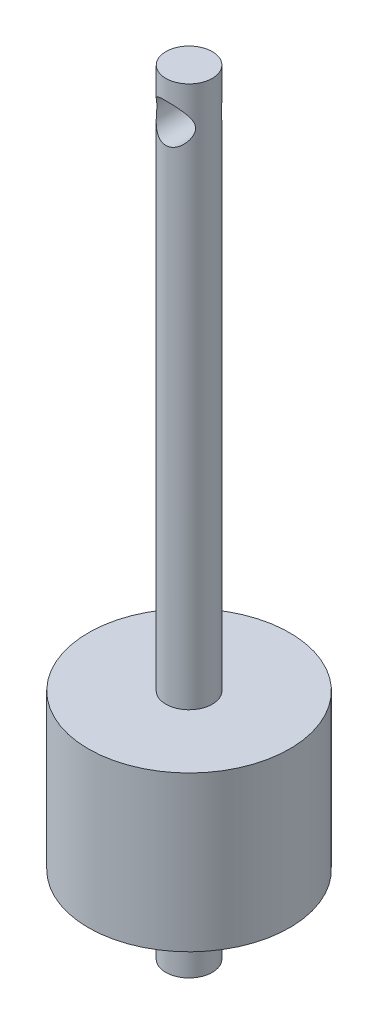
ISO-10303-21;
HEADER;
FILE_DESCRIPTION(('STEP AP214'),'2;1');
FILE_NAME('part.step','',(''),(''),'','','');
FILE_SCHEMA(('AUTOMOTIVE_DESIGN { 1 0 10303 214 1 1 1 1 }'));
ENDSEC;
DATA;
#1=APPLICATION_CONTEXT('core data for automotive mechanical design processes');
#2=APPLICATION_PROTOCOL_DEFINITION('international standard','automotive_design',2000,#1);
#3=PRODUCT_CONTEXT('',#1,'mechanical');
#4=PRODUCT('Part','Part','',(#3));
#5=PRODUCT_RELATED_PRODUCT_CATEGORY('part','',(#4));
#6=PRODUCT_DEFINITION_FORMATION('','',#4);
#7=PRODUCT_DEFINITION_CONTEXT('part definition',#1,'design');
#8=PRODUCT_DEFINITION('design','',#6,#7);
#9=PRODUCT_DEFINITION_SHAPE('','',#8);
#10=(LENGTH_UNIT() NAMED_UNIT(*) SI_UNIT(.MILLI.,.METRE.));
#11=(NAMED_UNIT(*) PLANE_ANGLE_UNIT() SI_UNIT($,.RADIAN.));
#12=(NAMED_UNIT(*) SI_UNIT($,.STERADIAN.) SOLID_ANGLE_UNIT());
#13=UNCERTAINTY_MEASURE_WITH_UNIT(LENGTH_MEASURE(1.E-05),#10,'distance_accuracy_value','');
#14=(GEOMETRIC_REPRESENTATION_CONTEXT(3) GLOBAL_UNCERTAINTY_ASSIGNED_CONTEXT((#13)) GLOBAL_UNIT_ASSIGNED_CONTEXT((#10,
#11,#12)) REPRESENTATION_CONTEXT('',''));
#15=CARTESIAN_POINT('',(0.,0.,0.));
#16=DIRECTION('',(0.,0.,1.));
#17=DIRECTION('',(1.,0.,0.));
#18=AXIS2_PLACEMENT_3D('',#15,#16,#17);
#19=CARTESIAN_POINT('',(-3.,0.,0.));
#20=DIRECTION('',(0.,1.,0.));
#21=DIRECTION('',(0.,0.,1.));
#22=AXIS2_PLACEMENT_3D('',#19,#20,#21);
#23=PLANE('',#22);
#24=CARTESIAN_POINT('',(0.,0.,0.));
#25=DIRECTION('',(0.,1.,0.));
#26=DIRECTION('',(0.,0.,1.));
#27=AXIS2_PLACEMENT_3D('',#24,#25,#26);
#28=CIRCLE('',#27,3.);
#29=CARTESIAN_POINT('',(0.,0.,3.));
#30=VERTEX_POINT('',#29);
#31=EDGE_CURVE('E81',#30,#30,#28,.T.);
#32=ORIENTED_EDGE('',*,*,#31,.T.);
#33=EDGE_LOOP('',(#32));
#34=FACE_BOUND('',#33,.T.);
#35=ADVANCED_FACE('F31',(#34),#23,.T.);
#36=CARTESIAN_POINT('',(0.,-100.,0.));
#37=DIRECTION('',(0.,-1.,0.));
#38=DIRECTION('',(0.,0.,-1.));
#39=AXIS2_PLACEMENT_3D('',#36,#37,#38);
#40=PLANE('',#39);
#41=CARTESIAN_POINT('',(0.,-100.,0.));
#42=DIRECTION('',(0.,1.,0.));
#43=DIRECTION('',(0.,0.,1.));
#44=AXIS2_PLACEMENT_3D('',#41,#42,#43);
#45=CIRCLE('',#44,2.99999999999999);
#46=CARTESIAN_POINT('',(0.,-100.,2.99999999999999));
#47=VERTEX_POINT('',#46);
#48=EDGE_CURVE('E10',#47,#47,#45,.T.);
#49=ORIENTED_EDGE('',*,*,#48,.F.);
#50=EDGE_LOOP('',(#49));
#51=FACE_BOUND('',#50,.T.);
#52=ADVANCED_FACE('F72',(#51),#40,.T.);
#53=CARTESIAN_POINT('',(0.,0.,0.));
#54=DIRECTION('',(0.,1.,0.));
#55=DIRECTION('',(0.,0.,1.));
#56=AXIS2_PLACEMENT_3D('',#53,#54,#55);
#57=CYLINDRICAL_SURFACE('',#56,2.99999999999999);
#58=ORIENTED_EDGE('',*,*,#48,.T.);
#59=EDGE_LOOP('',(#58));
#60=FACE_BOUND('',#59,.T.);
#61=CARTESIAN_POINT('',(0.,-90.,0.));
#62=DIRECTION('',(0.,1.,0.));
#63=DIRECTION('',(0.,0.,1.));
#64=AXIS2_PLACEMENT_3D('',#61,#62,#63);
#65=CIRCLE('',#64,2.99999999999999);
#66=CARTESIAN_POINT('',(0.,-90.,2.99999999999999));
#67=VERTEX_POINT('',#66);
#68=EDGE_CURVE('E43',#67,#67,#65,.T.);
#69=ORIENTED_EDGE('',*,*,#68,.F.);
#70=EDGE_LOOP('',(#69));
#71=FACE_BOUND('',#70,.T.);
#72=ADVANCED_FACE('F77',(#60,#71),#57,.T.);
#73=CARTESIAN_POINT('',(-2.99999999999999,-90.,0.));
#74=DIRECTION('',(0.,-1.,0.));
#75=DIRECTION('',(0.,0.,-1.));
#76=AXIS2_PLACEMENT_3D('',#73,#74,#75);
#77=PLANE('',#76);
#78=ORIENTED_EDGE('',*,*,#68,.T.);
#79=EDGE_LOOP('',(#78));
#80=FACE_BOUND('',#79,.T.);
#81=CARTESIAN_POINT('',(0.,-90.,0.));
#82=DIRECTION('',(0.,1.,0.));
#83=DIRECTION('',(0.,0.,1.));
#84=AXIS2_PLACEMENT_3D('',#81,#82,#83);
#85=CIRCLE('',#84,13.);
#86=CARTESIAN_POINT('',(0.,-90.,13.));
#87=VERTEX_POINT('',#86);
#88=EDGE_CURVE('E48',#87,#87,#85,.T.);
#89=ORIENTED_EDGE('',*,*,#88,.F.);
#90=EDGE_LOOP('',(#89));
#91=FACE_BOUND('',#90,.T.);
#92=ADVANCED_FACE('F96',(#80,#91),#77,.T.);
#93=CARTESIAN_POINT('',(0.,0.,0.));
#94=DIRECTION('',(0.,1.,0.));
#95=DIRECTION('',(0.,0.,1.));
#96=AXIS2_PLACEMENT_3D('',#93,#94,#95);
#97=CYLINDRICAL_SURFACE('',#96,13.);
#98=ORIENTED_EDGE('',*,*,#88,.T.);
#99=EDGE_LOOP('',(#98));
#100=FACE_BOUND('',#99,.T.);
#101=CARTESIAN_POINT('',(0.,-70.,0.));
#102=DIRECTION('',(0.,1.,0.));
#103=DIRECTION('',(0.,0.,1.));
#104=AXIS2_PLACEMENT_3D('',#101,#102,#103);
#105=CIRCLE('',#104,13.);
#106=CARTESIAN_POINT('',(0.,-70.,13.));
#107=VERTEX_POINT('',#106);
#108=EDGE_CURVE('E86',#107,#107,#105,.T.);
#109=ORIENTED_EDGE('',*,*,#108,.F.);
#110=EDGE_LOOP('',(#109));
#111=FACE_BOUND('',#110,.T.);
#112=ADVANCED_FACE('F93',(#100,#111),#97,.T.);
#113=CARTESIAN_POINT('',(-13.,-70.,0.));
#114=DIRECTION('',(0.,1.,0.));
#115=DIRECTION('',(0.,0.,1.));
#116=AXIS2_PLACEMENT_3D('',#113,#114,#115);
#117=PLANE('',#116);
#118=ORIENTED_EDGE('',*,*,#108,.T.);
#119=EDGE_LOOP('',(#118));
#120=FACE_BOUND('',#119,.T.);
#121=CARTESIAN_POINT('',(0.,-70.,0.));
#122=DIRECTION('',(0.,1.,0.));
#123=DIRECTION('',(0.,0.,1.));
#124=AXIS2_PLACEMENT_3D('',#121,#122,#123);
#125=CIRCLE('',#124,3.);
#126=CARTESIAN_POINT('',(0.,-70.,3.));
#127=VERTEX_POINT('',#126);
#128=EDGE_CURVE('E83',#127,#127,#125,.T.);
#129=ORIENTED_EDGE('',*,*,#128,.F.);
#130=EDGE_LOOP('',(#129));
#131=FACE_BOUND('',#130,.T.);
#132=ADVANCED_FACE('F67',(#120,#131),#117,.T.);
#133=CARTESIAN_POINT('',(0.,0.,0.));
#134=DIRECTION('',(0.,1.,0.));
#135=DIRECTION('',(0.,0.,1.));
#136=AXIS2_PLACEMENT_3D('',#133,#134,#135);
#137=CYLINDRICAL_SURFACE('',#136,3.);
#138=CARTESIAN_POINT('',(0.,-7.5,3.));
#139=CARTESIAN_POINT('',(0.118757533193203,-7.49999511444632,2.99999522795205));
#140=CARTESIAN_POINT('',(0.237551281104128,-7.49147749609542,2.99288670594743));
#141=CARTESIAN_POINT('',(0.471182492492811,-7.45803727664817,2.96510762868268));
#142=CARTESIAN_POINT('',(0.586016959612418,-7.43310252602469,2.94442702942008));
#143=CARTESIAN_POINT('',(0.807829942407298,-7.36868788266729,2.89142690238865));
#144=CARTESIAN_POINT('',(0.914850920904902,-7.32929492564629,2.8591769655007));
#145=CARTESIAN_POINT('',(1.11984139043408,-7.23798295205742,2.78529176182903));
#146=CARTESIAN_POINT('',(1.21780780775234,-7.18605970332675,2.74365332434937));
#147=CARTESIAN_POINT('',(1.43789998519767,-7.05054625019184,2.63674191529867));
#148=CARTESIAN_POINT('',(1.5556821965722,-6.96232979581782,2.56840549256191));
#149=CARTESIAN_POINT('',(1.77202398328147,-6.76947567424863,2.42422624777674));
#150=CARTESIAN_POINT('',(1.87052845158605,-6.66479243075689,2.34836281453276));
#151=CARTESIAN_POINT('',(2.00437263805589,-6.49591572350891,2.23294886313738));
#152=CARTESIAN_POINT('',(2.04699726278816,-6.4370444238087,2.19383679994997));
#153=CARTESIAN_POINT('',(2.12715295529554,-6.3154943970395,2.11620611809194));
#154=CARTESIAN_POINT('',(2.16468231743739,-6.25281440512926,2.07768770195023));
#155=CARTESIAN_POINT('',(2.23441122570746,-6.12373267566439,2.00250543288661));
#156=CARTESIAN_POINT('',(2.26662332666227,-6.05734021527518,1.96583735754651));
#157=CARTESIAN_POINT('',(2.32553690612792,-5.92055371607161,1.89577686630312));
#158=CARTESIAN_POINT('',(2.3522430799868,-5.85016315265821,1.86238167220904));
#159=CARTESIAN_POINT('',(2.40193513934005,-5.6983329097999,1.79791918980412));
#160=CARTESIAN_POINT('',(2.42433807692598,-5.61647590727652,1.76736311251003));
#161=CARTESIAN_POINT('',(2.46101313675502,-5.4481102311869,1.71593180556004));
#162=CARTESIAN_POINT('',(2.47530499393792,-5.36161341338533,1.69503310194197));
#163=CARTESIAN_POINT('',(2.49481072799048,-5.18423459162055,1.66620928968844));
#164=CARTESIAN_POINT('',(2.49991205058667,-5.09331204092931,1.65844510563093));
#165=CARTESIAN_POINT('',(2.5000856937119,-4.91143738699724,1.65818308531825));
#166=CARTESIAN_POINT('',(2.49515788278405,-4.82048528338467,1.6656854491694));
#167=CARTESIAN_POINT('',(2.47505262029594,-4.63447528917288,1.69541639464498));
#168=CARTESIAN_POINT('',(2.45905577113332,-4.53970625428294,1.71881932066467));
#169=CARTESIAN_POINT('',(2.41742550503027,-4.35578901879783,1.77688235738914));
#170=CARTESIAN_POINT('',(2.39176011044289,-4.26666062928518,1.81157977103025));
#171=CARTESIAN_POINT('',(2.33816270346873,-4.1121729214589,1.88002226126137));
#172=CARTESIAN_POINT('',(2.31177513033566,-4.04568775758835,1.91250316845439));
#173=CARTESIAN_POINT('',(2.25404424958636,-3.91634919322007,1.98021996661529));
#174=CARTESIAN_POINT('',(2.22269803586306,-3.85349795213417,2.01545746697786));
#175=CARTESIAN_POINT('',(2.12149677560466,-3.67003315898033,2.12342648109725));
#176=CARTESIAN_POINT('',(2.04450664231777,-3.55458585239392,2.19837696967438));
#177=CARTESIAN_POINT('',(1.86765914501414,-3.33173303754566,2.35079897952278));
#178=CARTESIAN_POINT('',(1.76681805277629,-3.22506167600812,2.42819792618944));
#179=CARTESIAN_POINT('',(1.54484388336149,-3.0288876551826,2.57509054043285));
#180=CARTESIAN_POINT('',(1.42375565615774,-2.93934796694374,2.64460112267364));
#181=CARTESIAN_POINT('',(1.19411179169416,-2.80058516090145,2.75428914126547));
#182=CARTESIAN_POINT('',(1.08972732107277,-2.74685710181235,2.79748350073995));
#183=CARTESIAN_POINT('',(0.87107145833037,-2.65365725474466,2.87307804019801));
#184=CARTESIAN_POINT('',(0.756806292780766,-2.61417656841943,2.90548495660805));
#185=CARTESIAN_POINT('',(0.519954301215421,-2.5515827500678,2.95709834265565));
#186=CARTESIAN_POINT('',(0.39731092312531,-2.52859605334244,2.97620280955844));
#187=CARTESIAN_POINT('',(0.148559976923728,-2.50129076807281,2.99891434528972));
#188=CARTESIAN_POINT('',(0.0224547835240029,-2.49695968914984,3.00253178304177));
#189=CARTESIAN_POINT('',(-0.213310199456575,-2.50666243944376,2.99444999039147));
#190=CARTESIAN_POINT('',(-0.323130540835859,-2.51855863871517,2.98453350716313));
#191=CARTESIAN_POINT('',(-0.538644964400605,-2.55626695021149,2.95325589460136));
#192=CARTESIAN_POINT('',(-0.644338549989562,-2.58208073171896,2.93189339242796));
#193=CARTESIAN_POINT('',(-0.850565499199257,-2.64662339545526,2.87889521546186));
#194=CARTESIAN_POINT('',(-0.951010682223317,-2.68552078944427,2.84712564891974));
#195=CARTESIAN_POINT('',(-1.14365900898104,-2.7743956323367,2.7753612473389));
#196=CARTESIAN_POINT('',(-1.2358590883121,-2.82437717699329,2.73536337221808));
#197=CARTESIAN_POINT('',(-1.45067439735099,-2.95843179534697,2.62975152158594));
#198=CARTESIAN_POINT('',(-1.56834359540731,-3.0477325832673,2.56070244234714));
#199=CARTESIAN_POINT('',(-1.78428994740848,-3.24284038265563,2.41522445403191));
#200=CARTESIAN_POINT('',(-1.88250490855173,-3.34869845535475,2.33877300422835));
#201=CARTESIAN_POINT('',(-2.01573314784291,-3.51941196792861,2.22269805598601));
#202=CARTESIAN_POINT('',(-2.05811069143949,-3.57889827297599,2.1834115173603));
#203=CARTESIAN_POINT('',(-2.13771669597406,-3.70172081603228,2.10553153817181));
#204=CARTESIAN_POINT('',(-2.17494330406755,-3.7650584276641,2.06693835133607));
#205=CARTESIAN_POINT('',(-2.24398857026757,-3.89548840391519,1.9917610848264));
#206=CARTESIAN_POINT('',(-2.27582148781538,-3.96257022453361,1.95517188634212));
#207=CARTESIAN_POINT('',(-2.3338885673946,-4.10079010449983,1.88547561448179));
#208=CARTESIAN_POINT('',(-2.36012785984655,-4.17192437041937,1.85236536450791));
#209=CARTESIAN_POINT('',(-2.40837357148322,-4.32427036835189,1.78925557416047));
#210=CARTESIAN_POINT('',(-2.42988314318545,-4.40583445107373,1.75970711786654));
#211=CARTESIAN_POINT('',(-2.46482255689514,-4.5734519539426,1.71043063887427));
#212=CARTESIAN_POINT('',(-2.47827257713357,-4.65949357132788,1.69067811225259));
#213=CARTESIAN_POINT('',(-2.49617289535263,-4.83563760741233,1.6641531597946));
#214=CARTESIAN_POINT('',(-2.5005179918396,-4.92577532975069,1.65753251048391));
#215=CARTESIAN_POINT('',(-2.49938197104456,-5.10585321278394,1.65924308630667));
#216=CARTESIAN_POINT('',(-2.49389826274012,-5.19579331512514,1.66757825402155));
#217=CARTESIAN_POINT('',(-2.47265263848541,-5.38167257539052,1.6989289873552));
#218=CARTESIAN_POINT('',(-2.45585812550761,-5.47723027053268,1.72341371023858));
#219=CARTESIAN_POINT('',(-2.41250339675091,-5.66253129608271,1.78358728037387));
#220=CARTESIAN_POINT('',(-2.38591088285909,-5.7522542287093,1.81931312531326));
#221=CARTESIAN_POINT('',(-2.33050835844919,-5.90778904135484,1.88952619366194));
#222=CARTESIAN_POINT('',(-2.30325853049531,-5.97474375923492,1.92277816627791));
#223=CARTESIAN_POINT('',(-2.24370627018012,-6.1049463864244,1.99195185230571));
#224=CARTESIAN_POINT('',(-2.21140090020864,-6.16819211099981,2.0278751115052));
#225=CARTESIAN_POINT('',(-2.10716294428985,-6.35272956134196,2.13775931167912));
#226=CARTESIAN_POINT('',(-2.02793576743751,-6.46874692499193,2.2137978016432));
#227=CARTESIAN_POINT('',(-1.84629697567414,-6.69200726129125,2.36772603763546));
#228=CARTESIAN_POINT('',(-1.74293959593281,-6.79854179403292,2.44552394429512));
#229=CARTESIAN_POINT('',(-1.51553554935621,-6.99386379953934,2.59256498427754));
#230=CARTESIAN_POINT('',(-1.39153583663216,-7.08269056587395,2.66182692543068));
#231=CARTESIAN_POINT('',(-1.15855518141083,-7.21831419672309,2.76942305781508));
#232=CARTESIAN_POINT('',(-1.05399877947694,-7.27003851021944,2.81112174006882));
#233=CARTESIAN_POINT('',(-0.835439786054361,-7.35921867023858,2.88361460666453));
#234=CARTESIAN_POINT('',(-0.721450026753907,-7.39669352409529,2.9144233132377));
#235=CARTESIAN_POINT('',(-0.506620038886859,-7.45018845582659,2.95858745904691));
#236=CARTESIAN_POINT('',(-0.406845468761923,-7.46877512222678,2.97402142398111));
#237=CARTESIAN_POINT('',(-0.204722725654236,-7.49368236823808,2.99472922794408));
#238=CARTESIAN_POINT('',(-0.102374818922783,-7.50000421158692,3.00000411373941));
#239=CARTESIAN_POINT('',(0.,-7.5,3.));
#240=B_SPLINE_CURVE_WITH_KNOTS('',3,(#138,#139,#140,#141,#142,#143,#144,#145,#146,#147,#148,
#149,#150,#151,#152,#153,#154,#155,#156,#157,#158,#159,#160,#161,#162,#163,#164,#165,#166,#167,
#168,#169,#170,#171,#172,#173,#174,#175,#176,#177,#178,#179,#180,#181,#182,#183,#184,#185,#186,
#187,#188,#189,#190,#191,#192,#193,#194,#195,#196,#197,#198,#199,#200,#201,#202,#203,#204,#205,
#206,#207,#208,#209,#210,#211,#212,#213,#214,#215,#216,#217,#218,#219,#220,#221,#222,#223,#224,
#225,#226,#227,#228,#229,#230,#231,#232,#233,#234,#235,#236,#237,#238,#239),.UNSPECIFIED.,.T.,
.F.,(4,2,2,2,2,2,2,2,2,2,2,2,2,2,2,2,2,2,2,2,2,2,2,2,2,2,2,2,2,2,2,2,2,2,2,2,2,2,2,2,2,2,2,2,2,
2,2,2,2,2,4),(0.,0.355841276815114,0.711946191026962,1.06594405359551,1.42006164830116,
1.90425178760127,2.38980643116775,2.63722280423449,2.88472179650724,3.13162777943676,
3.37832232674674,3.64812890035754,3.91727616616869,4.18969776924975,4.46212294312047,
4.75723524199722,5.05333228584568,5.28870178855694,5.52420974868633,5.9954933935898,
6.49137310548271,6.98616858956867,7.36002155957575,7.73364063000475,8.11009395319721,
8.48629519274361,8.81743460677926,9.14861374669872,9.48423297747607,9.81997643164434,
10.3065635514456,10.7946819775667,11.0432812121088,11.2919696391639,11.5399899810636,
11.787781852862,12.0551105531685,12.3217671309317,12.5914881373799,12.8612802568452,
13.1598101383752,13.4593330283462,13.6977271411687,13.9362602949129,14.4135864576438,
14.914300110886,15.413889999571,15.7841228897598,16.1538601797496,16.4606444271243,
16.7673970625124),.UNSPECIFIED.);
#241=CARTESIAN_POINT('',(0.,-7.5,3.));
#242=VERTEX_POINT('',#241);
#243=EDGE_CURVE('E34',#242,#242,#240,.T.);
#244=ORIENTED_EDGE('',*,*,#243,.F.);
#245=EDGE_LOOP('',(#244));
#246=FACE_BOUND('',#245,.T.);
#247=CARTESIAN_POINT('',(2.5,-5.,-1.6583123951777));
#248=CARTESIAN_POINT('',(2.49999381779257,-5.08830441018556,-1.65832848527777));
#249=CARTESIAN_POINT('',(2.49526266006825,-5.17675978600982,-1.6655210686776));
#250=CARTESIAN_POINT('',(2.47682990119872,-5.35077788390269,-1.69279627564258));
#251=CARTESIAN_POINT('',(2.46309747522165,-5.43632959968507,-1.71292318814634));
#252=CARTESIAN_POINT('',(2.42086856120702,-5.63510531064233,-1.7723311567861));
#253=CARTESIAN_POINT('',(2.38871146123827,-5.74619165448741,-1.81601359579225));
#254=CARTESIAN_POINT('',(2.31147102501776,-5.95917781657519,-1.91336767201443));
#255=CARTESIAN_POINT('',(2.26634586338956,-6.061046484653,-1.96707143083862));
#256=CARTESIAN_POINT('',(2.17847435315541,-6.22904561401217,-2.0633128033891));
#257=CARTESIAN_POINT('',(2.1385289521929,-6.29726159135526,-2.10482488185012));
#258=CARTESIAN_POINT('',(2.05264418187204,-6.42928710039743,-2.18866644492365));
#259=CARTESIAN_POINT('',(2.00670223718894,-6.49309472073759,-2.23099627404094));
#260=CARTESIAN_POINT('',(1.86006177209498,-6.6777567676036,-2.35727388143592));
#261=CARTESIAN_POINT('',(1.75039822318641,-6.79213663242395,-2.44068431676979));
#262=CARTESIAN_POINT('',(1.53331236095276,-6.97859400578864,-2.58108364411647));
#263=CARTESIAN_POINT('',(1.43034863494402,-7.05449822257983,-2.63992409122052));
#264=CARTESIAN_POINT('',(1.2102730649704,-7.19133705739221,-2.74775790284001));
#265=CARTESIAN_POINT('',(1.0931846025589,-7.25229592151062,-2.79676719280152));
#266=CARTESIAN_POINT('',(0.867930574105452,-7.34711286507275,-2.87372923790461));
#267=CARTESIAN_POINT('',(0.761720558967915,-7.38383396465568,-2.90385730730848));
#268=CARTESIAN_POINT('',(0.542834165009171,-7.44298040968634,-2.9526038261635));
#269=CARTESIAN_POINT('',(0.430161553726257,-7.46541399390808,-2.97122890852624));
#270=CARTESIAN_POINT('',(0.200906197669826,-7.49460149564534,-2.99549160197878));
#271=CARTESIAN_POINT('',(0.0843091426465969,-7.50128982974754,-3.00107488956406));
#272=CARTESIAN_POINT('',(-0.148527393661063,-7.4982977548847,-2.99858143529682));
#273=CARTESIAN_POINT('',(-0.264766882809716,-7.48861770853832,-2.99050499605651));
#274=CARTESIAN_POINT('',(-0.485446031322613,-7.45478575045629,-2.96241335973365));
#275=CARTESIAN_POINT('',(-0.590154005534433,-7.43164888215419,-2.9432359451617));
#276=CARTESIAN_POINT('',(-0.793626256853986,-7.37305216876755,-2.89501312358898));
#277=CARTESIAN_POINT('',(-0.892389678949309,-7.33759055594486,-2.86596630103235));
#278=CARTESIAN_POINT('',(-1.09053364635439,-7.25240882854878,-2.79690305459733));
#279=CARTESIAN_POINT('',(-1.18924374927733,-7.20172823083574,-2.75616061923451));
#280=CARTESIAN_POINT('',(-1.37677917974558,-7.08960330706299,-2.66744762527376));
#281=CARTESIAN_POINT('',(-1.46559550453314,-7.02814930658852,-2.61947057552121));
#282=CARTESIAN_POINT('',(-1.67280381279727,-6.86454067552574,-2.4944878939135));
#283=CARTESIAN_POINT('',(-1.78517417530476,-6.75692877660215,-2.41452783856826));
#284=CARTESIAN_POINT('',(-1.93670187620853,-6.582759697277,-2.29203945368863));
#285=CARTESIAN_POINT('',(-1.98442734415742,-6.522485831693,-2.25072631897241));
#286=CARTESIAN_POINT('',(-2.07418694298424,-6.39772821451074,-2.16828375986482));
#287=CARTESIAN_POINT('',(-2.11622312017878,-6.33324598900508,-2.12715427459339));
#288=CARTESIAN_POINT('',(-2.21282833126485,-6.16888139552588,-2.02736013921577));
#289=CARTESIAN_POINT('',(-2.26407571910762,-6.06653640056607,-1.96948181658004));
#290=CARTESIAN_POINT('',(-2.35314050085765,-5.85213882846276,-1.86213853666711));
#291=CARTESIAN_POINT('',(-2.39099600305927,-5.74011494437315,-1.81264991817824));
#292=CARTESIAN_POINT('',(-2.4414108954061,-5.544179547488,-1.74376607660709));
#293=CARTESIAN_POINT('',(-2.45819358164965,-5.46300124971664,-1.71981949257405));
#294=CARTESIAN_POINT('',(-2.48370273222149,-5.29703885432526,-1.68277668804568));
#295=CARTESIAN_POINT('',(-2.49244814091896,-5.21226373110501,-1.66965496020135));
#296=CARTESIAN_POINT('',(-2.50115517387014,-5.04057229342954,-1.65659310081955));
#297=CARTESIAN_POINT('',(-2.5010533736449,-4.95364498533259,-1.65674814862693));
#298=CARTESIAN_POINT('',(-2.49191597272525,-4.78129431248646,-1.67045143445787));
#299=CARTESIAN_POINT('',(-2.48286800185718,-4.69587319686985,-1.68401821733787));
#300=CARTESIAN_POINT('',(-2.45336046117379,-4.50781554266095,-1.72679886038489));
#301=CARTESIAN_POINT('',(-2.43059717464989,-4.40627503149537,-1.75909755109212));
#302=CARTESIAN_POINT('',(-2.3742256798351,-4.2103675536006,-1.83446297156782));
#303=CARTESIAN_POINT('',(-2.34058163140775,-4.11602558530722,-1.87756517999229));
#304=CARTESIAN_POINT('',(-2.27197464095646,-3.95400521670673,-1.95968409590129));
#305=CARTESIAN_POINT('',(-2.23884949579965,-3.88495426025227,-1.99758766640253));
#306=CARTESIAN_POINT('',(-2.16695951166941,-3.75097150279243,-2.07535316303084));
#307=CARTESIAN_POINT('',(-2.12819176063911,-3.68604185372639,-2.11521609327316));
#308=CARTESIAN_POINT('',(-2.04513177456922,-3.56016609417345,-2.1956272895707));
#309=CARTESIAN_POINT('',(-2.00083502832488,-3.49922329923607,-2.23617609161424));
#310=CARTESIAN_POINT('',(-1.90679633939304,-3.38141505089946,-2.31689068931587));
#311=CARTESIAN_POINT('',(-1.85705157250686,-3.32455173778171,-2.3570562744781));
#312=CARTESIAN_POINT('',(-1.69691470794631,-3.157545164817,-2.47761126043941));
#313=CARTESIAN_POINT('',(-1.57762869702065,-3.05406246128058,-2.55601135420397));
#314=CARTESIAN_POINT('',(-1.38213833429724,-2.91527936693939,-2.66368994822279));
#315=CARTESIAN_POINT('',(-1.3142814425198,-2.87178947048598,-2.69790353664307));
#316=CARTESIAN_POINT('',(-1.17320567310927,-2.79088325896634,-2.76217044277537));
#317=CARTESIAN_POINT('',(-1.09999000687014,-2.75346334884671,-2.79222622145722));
#318=CARTESIAN_POINT('',(-0.923231349702329,-2.67408265035646,-2.85642765987167));
#319=CARTESIAN_POINT('',(-0.817729906619419,-2.63478317593362,-2.88858366145246));
#320=CARTESIAN_POINT('',(-0.599797532910351,-2.57036375174947,-2.94156350531484));
#321=CARTESIAN_POINT('',(-0.487372072128381,-2.54523276456155,-2.96239616816155));
#322=CARTESIAN_POINT('',(-0.257904014589444,-2.51062284815489,-2.99113754779354));
#323=CARTESIAN_POINT('',(-0.140841922250427,-2.50121928491646,-2.99898403281667));
#324=CARTESIAN_POINT('',(0.0935504369182226,-2.49900436847168,-3.00082959064104));
#325=CARTESIAN_POINT('',(0.210880683537412,-2.50619180350947,-2.99482967474112));
#326=CARTESIAN_POINT('',(0.433478999214017,-2.53549504701913,-2.97047572120601));
#327=CARTESIAN_POINT('',(0.539003381840974,-2.55648603675872,-2.95305281328287));
#328=CARTESIAN_POINT('',(0.744442226622885,-2.61104385226379,-2.9080705750889));
#329=CARTESIAN_POINT('',(0.84435580868807,-2.64461264463713,-2.88050965969777));
#330=CARTESIAN_POINT('',(1.0438405515299,-2.72561715528201,-2.81464343863442));
#331=CARTESIAN_POINT('',(1.1428617285401,-2.77388177210471,-2.77570403743571));
#332=CARTESIAN_POINT('',(1.33135097301228,-2.88120493288353,-2.69039800671957));
#333=CARTESIAN_POINT('',(1.42081159008167,-2.94027179907293,-2.64402565415891));
#334=CARTESIAN_POINT('',(1.63002558091947,-3.09804374762575,-2.52264851028665));
#335=CARTESIAN_POINT('',(1.74390511945051,-3.20222635674885,-2.44452820472334));
#336=CARTESIAN_POINT('',(1.89807730985019,-3.37115372927623,-2.32413331941839));
#337=CARTESIAN_POINT('',(1.94675534900064,-3.42967130049815,-2.28340098508491));
#338=CARTESIAN_POINT('',(2.03855478653209,-3.55084146972598,-2.20183068446821));
#339=CARTESIAN_POINT('',(2.08167789496708,-3.61349278615735,-2.16099275466));
#340=CARTESIAN_POINT('',(2.18509588569703,-3.77949168851252,-2.05749735800433));
#341=CARTESIAN_POINT('',(2.24133685872229,-3.88584234834629,-1.99554062285107));
#342=CARTESIAN_POINT('',(2.33909634990328,-4.10925568471052,-1.8799763526203));
#343=CARTESIAN_POINT('',(2.38065496503423,-4.22628807105596,-1.82634630603961));
#344=CARTESIAN_POINT('',(2.43556494992113,-4.42987423646261,-1.75197107121731));
#345=CARTESIAN_POINT('',(2.4537026175718,-4.51327379220161,-1.72624379189026));
#346=CARTESIAN_POINT('',(2.48144437754558,-4.68402786882599,-1.68613426001934));
#347=CARTESIAN_POINT('',(2.49108129246948,-4.7713657969327,-1.67170839549487));
#348=CARTESIAN_POINT('',(2.49736160836694,-4.88279132481347,-1.66228358000323));
#349=CARTESIAN_POINT('',(2.49834926640805,-4.90619282487559,-1.66079886805539));
#350=CARTESIAN_POINT('',(2.49966934514013,-4.9530593193922,-1.65881104526667));
#351=CARTESIAN_POINT('',(2.50000164353618,-4.97652432487935,-1.65830811763413));
#352=CARTESIAN_POINT('',(2.5,-5.,-1.6583123951777));
#353=B_SPLINE_CURVE_WITH_KNOTS('',3,(#247,#248,#249,#250,#251,#252,#253,#254,#255,#256,#257,
#258,#259,#260,#261,#262,#263,#264,#265,#266,#267,#268,#269,#270,#271,#272,#273,#274,#275,#276,
#277,#278,#279,#280,#281,#282,#283,#284,#285,#286,#287,#288,#289,#290,#291,#292,#293,#294,#295,
#296,#297,#298,#299,#300,#301,#302,#303,#304,#305,#306,#307,#308,#309,#310,#311,#312,#313,#314,
#315,#316,#317,#318,#319,#320,#321,#322,#323,#324,#325,#326,#327,#328,#329,#330,#331,#332,#333,
#334,#335,#336,#337,#338,#339,#340,#341,#342,#343,#344,#345,#346,#347,#348,#349,#350,#351,#352),
.UNSPECIFIED.,.T.,.F.,(4,2,2,2,2,2,2,2,2,2,2,2,2,2,2,2,2,2,2,2,2,2,2,2,2,2,2,2,2,2,2,2,2,2,2,2,
2,2,2,2,2,2,2,2,2,2,2,2,2,2,2,2,4),(0.,0.264807486843959,0.530526577859135,0.899311711113918,
1.26929988428696,1.53684271887074,1.80450083499514,2.33872733232382,2.75963734355717,
3.17985991852653,3.52745225260399,3.87484396861114,4.22368012855136,4.57250856061374,
4.89792180788528,5.22338174845522,5.57669292749804,5.93032301720748,6.45212646169812,
6.71375344417635,6.97528607349791,7.35902155845295,7.74165612186457,7.99961659145732,
8.25696746076718,8.51616339578941,8.77571823174392,9.10077852677669,9.42692063321702,
9.68296205217761,9.93913608157881,10.1955205112228,10.4520384827407,10.9775613091595,
11.2398627749287,11.502008316419,11.8517559716833,12.2012307913941,12.5523755496757,
12.903494662228,13.2290536025831,13.5546634671053,13.9038797714121,14.2533662599301,
14.7693582552692,15.0281495003973,15.2868608867407,15.691662084526,16.0953490806584,
16.3618811606765,16.6273795605045,16.697765340701,16.7681642541596),.UNSPECIFIED.);
#354=CARTESIAN_POINT('',(2.5,-5.,-1.6583123951777));
#355=VERTEX_POINT('',#354);
#356=EDGE_CURVE('E51',#355,#355,#353,.T.);
#357=ORIENTED_EDGE('',*,*,#356,.F.);
#358=EDGE_LOOP('',(#357));
#359=FACE_BOUND('',#358,.T.);
#360=ORIENTED_EDGE('',*,*,#128,.T.);
#361=EDGE_LOOP('',(#360));
#362=FACE_BOUND('',#361,.T.);
#363=ORIENTED_EDGE('',*,*,#31,.F.);
#364=EDGE_LOOP('',(#363));
#365=FACE_BOUND('',#364,.T.);
#366=ADVANCED_FACE('F56',(#246,#359,#362,#365),#137,.T.);
#367=CARTESIAN_POINT('',(0.,-5.,-13.));
#368=DIRECTION('',(0.,0.,1.));
#369=DIRECTION('',(1.,0.,0.));
#370=AXIS2_PLACEMENT_3D('',#367,#368,#369);
#371=CYLINDRICAL_SURFACE('',#370,2.5);
#372=ORIENTED_EDGE('',*,*,#243,.T.);
#373=EDGE_LOOP('',(#372));
#374=FACE_BOUND('',#373,.T.);
#375=ORIENTED_EDGE('',*,*,#356,.T.);
#376=EDGE_LOOP('',(#375));
#377=FACE_BOUND('',#376,.T.);
#378=ADVANCED_FACE('F59',(#374,#377),#371,.F.);
#379=CLOSED_SHELL('',(#35,#52,#72,#92,#112,#132,#366,#378));
#380=MANIFOLD_SOLID_BREP('B2',#379);
#381=ADVANCED_BREP_SHAPE_REPRESENTATION('',(#18,#380),#14);
#382=SHAPE_DEFINITION_REPRESENTATION(#9,#381);
ENDSEC;
END-ISO-10303-21;
